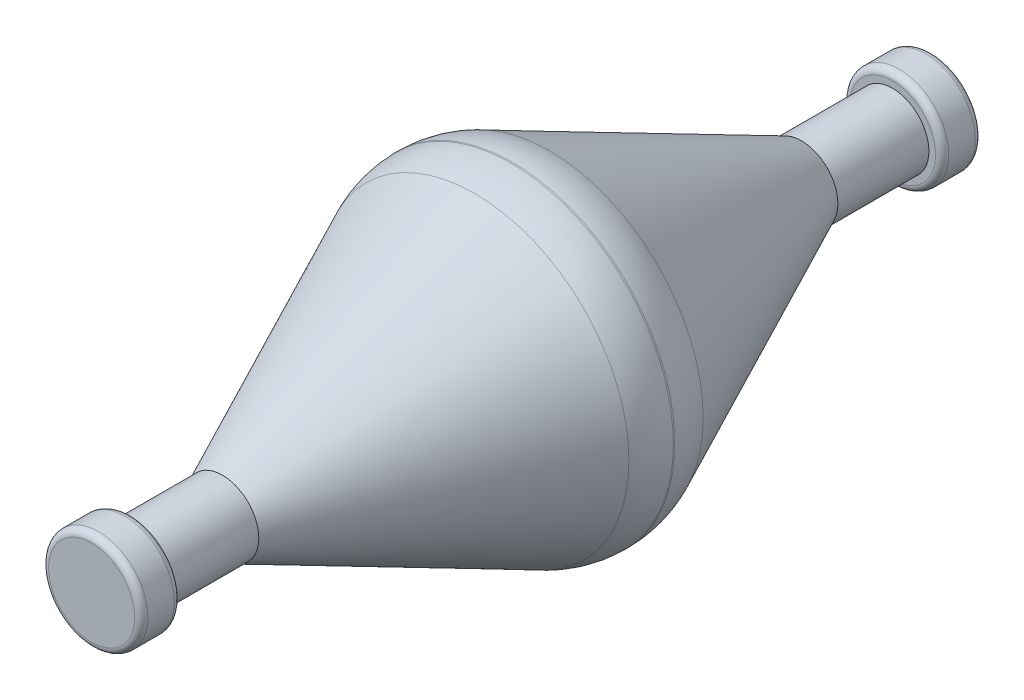
ISO-10303-21;
HEADER;
FILE_DESCRIPTION(('STEP AP214'),'2;1');
FILE_NAME('part.step','',(''),(''),'','','');
FILE_SCHEMA(('AUTOMOTIVE_DESIGN { 1 0 10303 214 1 1 1 1 }'));
ENDSEC;
DATA;
#1=APPLICATION_CONTEXT('core data for automotive mechanical design processes');
#2=APPLICATION_PROTOCOL_DEFINITION('international standard','automotive_design',2000,#1);
#3=PRODUCT_CONTEXT('',#1,'mechanical');
#4=PRODUCT('Part','Part','',(#3));
#5=PRODUCT_RELATED_PRODUCT_CATEGORY('part','',(#4));
#6=PRODUCT_DEFINITION_FORMATION('','',#4);
#7=PRODUCT_DEFINITION_CONTEXT('part definition',#1,'design');
#8=PRODUCT_DEFINITION('design','',#6,#7);
#9=PRODUCT_DEFINITION_SHAPE('','',#8);
#10=(LENGTH_UNIT() NAMED_UNIT(*) SI_UNIT(.MILLI.,.METRE.));
#11=(NAMED_UNIT(*) PLANE_ANGLE_UNIT() SI_UNIT($,.RADIAN.));
#12=(NAMED_UNIT(*) SI_UNIT($,.STERADIAN.) SOLID_ANGLE_UNIT());
#13=UNCERTAINTY_MEASURE_WITH_UNIT(LENGTH_MEASURE(1.E-05),#10,'distance_accuracy_value','');
#14=(GEOMETRIC_REPRESENTATION_CONTEXT(3) GLOBAL_UNCERTAINTY_ASSIGNED_CONTEXT((#13)) GLOBAL_UNIT_ASSIGNED_CONTEXT((#10,
#11,#12)) REPRESENTATION_CONTEXT('',''));
#15=CARTESIAN_POINT('',(0.,0.,0.));
#16=DIRECTION('',(0.,0.,1.));
#17=DIRECTION('',(1.,0.,0.));
#18=AXIS2_PLACEMENT_3D('',#15,#16,#17);
#19=CARTESIAN_POINT('',(0.,0.,-4.875));
#20=DIRECTION('',(0.,0.,1.));
#21=DIRECTION('',(1.,0.,0.));
#22=AXIS2_PLACEMENT_3D('',#19,#20,#21);
#23=CYLINDRICAL_SURFACE('',#22,1.375);
#24=CARTESIAN_POINT('',(0.,0.,21.9364078724202));
#25=DIRECTION('',(0.,0.,-1.));
#26=DIRECTION('',(-1.,0.,0.));
#27=AXIS2_PLACEMENT_3D('',#24,#25,#26);
#28=CIRCLE('',#27,1.375);
#29=CARTESIAN_POINT('',(-1.375,0.,21.9364078724202));
#30=VERTEX_POINT('',#29);
#31=EDGE_CURVE('E80',#30,#30,#28,.F.);
#32=ORIENTED_EDGE('',*,*,#31,.T.);
#33=EDGE_LOOP('',(#32));
#34=FACE_BOUND('',#33,.T.);
#35=CARTESIAN_POINT('',(0.,0.,25.375));
#36=DIRECTION('',(0.,0.,1.));
#37=DIRECTION('',(1.,0.,0.));
#38=AXIS2_PLACEMENT_3D('',#35,#36,#37);
#39=CIRCLE('',#38,1.375);
#40=CARTESIAN_POINT('',(1.375,0.,25.375));
#41=VERTEX_POINT('',#40);
#42=EDGE_CURVE('E87',#41,#41,#39,.F.);
#43=ORIENTED_EDGE('',*,*,#42,.T.);
#44=EDGE_LOOP('',(#43));
#45=FACE_BOUND('',#44,.T.);
#46=ADVANCED_FACE('F36',(#34,#45),#23,.T.);
#47=CARTESIAN_POINT('',(0.,0.,0.0635921275798177));
#48=DIRECTION('',(0.,0.,1.));
#49=DIRECTION('',(1.,0.,0.));
#50=AXIS2_PLACEMENT_3D('',#47,#48,#49);
#51=CIRCLE('',#50,1.375);
#52=CARTESIAN_POINT('',(1.375,0.,0.0635921275798177));
#53=VERTEX_POINT('',#52);
#54=EDGE_CURVE('E83',#53,#53,#51,.F.);
#55=ORIENTED_EDGE('',*,*,#54,.T.);
#56=EDGE_LOOP('',(#55));
#57=FACE_BOUND('',#56,.T.);
#58=CARTESIAN_POINT('',(0.,0.,-3.375));
#59=DIRECTION('',(0.,0.,-1.));
#60=DIRECTION('',(-1.,0.,0.));
#61=AXIS2_PLACEMENT_3D('',#58,#59,#60);
#62=CIRCLE('',#61,1.375);
#63=CARTESIAN_POINT('',(-1.375,0.,-3.375));
#64=VERTEX_POINT('',#63);
#65=EDGE_CURVE('E86',#64,#64,#62,.F.);
#66=ORIENTED_EDGE('',*,*,#65,.T.);
#67=EDGE_LOOP('',(#66));
#68=FACE_BOUND('',#67,.T.);
#69=ADVANCED_FACE('F93',(#57,#68),#23,.T.);
#70=CARTESIAN_POINT('',(0.,0.,22.));
#71=DIRECTION('',(0.,0.,-1.));
#72=DIRECTION('',(-1.,0.,0.));
#73=AXIS2_PLACEMENT_3D('',#70,#71,#72);
#74=CYLINDRICAL_SURFACE('',#73,6.125);
#75=CARTESIAN_POINT('',(0.,0.,11.0294923464104));
#76=DIRECTION('',(0.,0.,1.));
#77=DIRECTION('',(1.,0.,0.));
#78=AXIS2_PLACEMENT_3D('',#75,#76,#77);
#79=CIRCLE('',#78,6.125);
#80=CARTESIAN_POINT('',(6.125,0.,11.0294923464104));
#81=VERTEX_POINT('',#80);
#82=EDGE_CURVE('E74',#81,#81,#79,.F.);
#83=ORIENTED_EDGE('',*,*,#82,.T.);
#84=EDGE_LOOP('',(#83));
#85=FACE_BOUND('',#84,.T.);
#86=CARTESIAN_POINT('',(0.,0.,10.9705076535896));
#87=DIRECTION('',(0.,0.,-1.));
#88=DIRECTION('',(-1.,0.,0.));
#89=AXIS2_PLACEMENT_3D('',#86,#87,#88);
#90=CIRCLE('',#89,6.125);
#91=CARTESIAN_POINT('',(-6.125,0.,10.9705076535896));
#92=VERTEX_POINT('',#91);
#93=EDGE_CURVE('E77',#92,#92,#90,.F.);
#94=ORIENTED_EDGE('',*,*,#93,.T.);
#95=EDGE_LOOP('',(#94));
#96=FACE_BOUND('',#95,.T.);
#97=ADVANCED_FACE('F108',(#85,#96),#74,.T.);
#98=CARTESIAN_POINT('',(0.,0.,-3.375));
#99=DIRECTION('',(0.,0.,-1.));
#100=DIRECTION('',(-1.,0.,0.));
#101=AXIS2_PLACEMENT_3D('',#98,#99,#100);
#102=CYLINDRICAL_SURFACE('',#101,1.875);
#103=CARTESIAN_POINT('',(0.,0.,-3.625));
#104=DIRECTION('',(0.,0.,-1.));
#105=DIRECTION('',(-1.,0.,0.));
#106=AXIS2_PLACEMENT_3D('',#103,#104,#105);
#107=CIRCLE('',#106,1.875);
#108=CARTESIAN_POINT('',(-1.875,0.,-3.625));
#109=VERTEX_POINT('',#108);
#110=EDGE_CURVE('E62',#109,#109,#107,.T.);
#111=ORIENTED_EDGE('',*,*,#110,.T.);
#112=EDGE_LOOP('',(#111));
#113=FACE_BOUND('',#112,.T.);
#114=CARTESIAN_POINT('',(0.,0.,-4.625));
#115=DIRECTION('',(0.,0.,1.));
#116=DIRECTION('',(1.,0.,0.));
#117=AXIS2_PLACEMENT_3D('',#114,#115,#116);
#118=CIRCLE('',#117,1.875);
#119=CARTESIAN_POINT('',(1.875,0.,-4.625));
#120=VERTEX_POINT('',#119);
#121=EDGE_CURVE('E65',#120,#120,#118,.T.);
#122=ORIENTED_EDGE('',*,*,#121,.T.);
#123=EDGE_LOOP('',(#122));
#124=FACE_BOUND('',#123,.T.);
#125=ADVANCED_FACE('F98',(#113,#124),#102,.T.);
#126=CARTESIAN_POINT('',(0.,0.,-3.375));
#127=DIRECTION('',(0.,0.,-1.));
#128=DIRECTION('',(-1.,0.,0.));
#129=AXIS2_PLACEMENT_3D('',#126,#127,#128);
#130=PLANE('',#129);
#131=CARTESIAN_POINT('',(0.,0.,-3.375));
#132=DIRECTION('',(0.,0.,-1.));
#133=DIRECTION('',(-1.,0.,0.));
#134=AXIS2_PLACEMENT_3D('',#131,#132,#133);
#135=CIRCLE('',#134,1.625);
#136=CARTESIAN_POINT('',(-1.625,0.,-3.375));
#137=VERTEX_POINT('',#136);
#138=EDGE_CURVE('E59',#137,#137,#135,.F.);
#139=ORIENTED_EDGE('',*,*,#138,.T.);
#140=EDGE_LOOP('',(#139));
#141=FACE_BOUND('',#140,.T.);
#142=ORIENTED_EDGE('',*,*,#65,.F.);
#143=EDGE_LOOP('',(#142));
#144=FACE_BOUND('',#143,.T.);
#145=ADVANCED_FACE('F95',(#141,#144),#130,.F.);
#146=CARTESIAN_POINT('',(0.,0.,-4.875));
#147=DIRECTION('',(0.,0.,1.));
#148=DIRECTION('',(1.,0.,0.));
#149=AXIS2_PLACEMENT_3D('',#146,#147,#148);
#150=PLANE('',#149);
#151=CARTESIAN_POINT('',(0.,0.,-4.875));
#152=DIRECTION('',(0.,0.,1.));
#153=DIRECTION('',(1.,0.,0.));
#154=AXIS2_PLACEMENT_3D('',#151,#152,#153);
#155=CIRCLE('',#154,1.625);
#156=CARTESIAN_POINT('',(1.625,0.,-4.875));
#157=VERTEX_POINT('',#156);
#158=EDGE_CURVE('E56',#157,#157,#155,.F.);
#159=ORIENTED_EDGE('',*,*,#158,.T.);
#160=EDGE_LOOP('',(#159));
#161=FACE_BOUND('',#160,.T.);
#162=ADVANCED_FACE('F97',(#161),#150,.F.);
#163=CARTESIAN_POINT('',(0.,0.,25.375));
#164=DIRECTION('',(0.,0.,1.));
#165=DIRECTION('',(1.,0.,0.));
#166=AXIS2_PLACEMENT_3D('',#163,#164,#165);
#167=CYLINDRICAL_SURFACE('',#166,1.875);
#168=CARTESIAN_POINT('',(0.,0.,25.625));
#169=DIRECTION('',(0.,0.,1.));
#170=DIRECTION('',(1.,0.,0.));
#171=AXIS2_PLACEMENT_3D('',#168,#169,#170);
#172=CIRCLE('',#171,1.875);
#173=CARTESIAN_POINT('',(1.875,0.,25.625));
#174=VERTEX_POINT('',#173);
#175=EDGE_CURVE('E47',#174,#174,#172,.T.);
#176=ORIENTED_EDGE('',*,*,#175,.T.);
#177=EDGE_LOOP('',(#176));
#178=FACE_BOUND('',#177,.T.);
#179=CARTESIAN_POINT('',(0.,0.,26.625));
#180=DIRECTION('',(0.,0.,1.));
#181=DIRECTION('',(1.,0.,0.));
#182=AXIS2_PLACEMENT_3D('',#179,#180,#181);
#183=CIRCLE('',#182,1.875);
#184=CARTESIAN_POINT('',(1.875,0.,26.625));
#185=VERTEX_POINT('',#184);
#186=EDGE_CURVE('E51',#185,#185,#183,.F.);
#187=ORIENTED_EDGE('',*,*,#186,.T.);
#188=EDGE_LOOP('',(#187));
#189=FACE_BOUND('',#188,.T.);
#190=ADVANCED_FACE('F105',(#178,#189),#167,.T.);
#191=CARTESIAN_POINT('',(0.,0.,25.375));
#192=DIRECTION('',(0.,0.,1.));
#193=DIRECTION('',(1.,0.,0.));
#194=AXIS2_PLACEMENT_3D('',#191,#192,#193);
#195=PLANE('',#194);
#196=CARTESIAN_POINT('',(0.,0.,25.375));
#197=DIRECTION('',(0.,0.,1.));
#198=DIRECTION('',(1.,0.,0.));
#199=AXIS2_PLACEMENT_3D('',#196,#197,#198);
#200=CIRCLE('',#199,1.625);
#201=CARTESIAN_POINT('',(1.625,0.,25.375));
#202=VERTEX_POINT('',#201);
#203=EDGE_CURVE('E43',#202,#202,#200,.F.);
#204=ORIENTED_EDGE('',*,*,#203,.T.);
#205=EDGE_LOOP('',(#204));
#206=FACE_BOUND('',#205,.T.);
#207=ORIENTED_EDGE('',*,*,#42,.F.);
#208=EDGE_LOOP('',(#207));
#209=FACE_BOUND('',#208,.T.);
#210=ADVANCED_FACE('F167',(#206,#209),#195,.F.);
#211=CARTESIAN_POINT('',(0.,0.,26.875));
#212=DIRECTION('',(0.,0.,1.));
#213=DIRECTION('',(1.,0.,0.));
#214=AXIS2_PLACEMENT_3D('',#211,#212,#213);
#215=PLANE('',#214);
#216=CARTESIAN_POINT('',(0.,0.,26.875));
#217=DIRECTION('',(0.,0.,1.));
#218=DIRECTION('',(1.,0.,0.));
#219=AXIS2_PLACEMENT_3D('',#216,#217,#218);
#220=CIRCLE('',#219,1.625);
#221=CARTESIAN_POINT('',(1.625,0.,26.875));
#222=VERTEX_POINT('',#221);
#223=EDGE_CURVE('E10',#222,#222,#220,.T.);
#224=ORIENTED_EDGE('',*,*,#223,.T.);
#225=EDGE_LOOP('',(#224));
#226=FACE_BOUND('',#225,.T.);
#227=ADVANCED_FACE('F133',(#226),#215,.T.);
#228=CARTESIAN_POINT('',(0.,0.,10.25));
#229=DIRECTION('',(0.,0.,1.));
#230=DIRECTION('',(1.,0.,0.));
#231=AXIS2_PLACEMENT_3D('',#228,#229,#230);
#232=CONICAL_SURFACE('',#231,6.125,0.436332312998589);
#233=CARTESIAN_POINT('',(0.,0.,9.59699830293231));
#234=DIRECTION('',(0.,0.,1.));
#235=DIRECTION('',(1.,0.,0.));
#236=AXIS2_PLACEMENT_3D('',#233,#234,#235);
#237=CIRCLE('',#236,5.8205003078691);
#238=CARTESIAN_POINT('',(5.8205003078691,0.,9.59699830293231));
#239=VERTEX_POINT('',#238);
#240=EDGE_CURVE('E68',#239,#239,#237,.F.);
#241=CARTESIAN_POINT('',(5.8205003078691,0.,9.59699830293231));
#242=CARTESIAN_POINT('',(5.77419301299547,0.,9.49769198860572));
#243=CARTESIAN_POINT('',(5.72788571812183,0.,9.39838567427913));
#244=CARTESIAN_POINT('',(5.63527112837456,0.,9.19977304562595));
#245=CARTESIAN_POINT('',(5.58896383350092,0.,9.10046673129937));
#246=CARTESIAN_POINT('',(5.49634924375365,0.,8.90185410264619));
#247=CARTESIAN_POINT('',(5.45004194888001,0.,8.8025477883196));
#248=CARTESIAN_POINT('',(5.35742735913274,0.,8.60393515966642));
#249=CARTESIAN_POINT('',(5.3111200642591,0.,8.50462884533984));
#250=CARTESIAN_POINT('',(5.21850547451183,0.,8.30601621668666));
#251=CARTESIAN_POINT('',(5.17219817963819,0.,8.20670990236007));
#252=CARTESIAN_POINT('',(5.07958358989092,0.,8.00809727370689));
#253=CARTESIAN_POINT('',(5.03327629501728,0.,7.9087909593803));
#254=CARTESIAN_POINT('',(4.94066170527001,0.,7.71017833072713));
#255=CARTESIAN_POINT('',(4.89435441039637,0.,7.61087201640054));
#256=CARTESIAN_POINT('',(4.8017398206491,0.,7.41225938774736));
#257=CARTESIAN_POINT('',(4.75543252577546,0.,7.31295307342078));
#258=CARTESIAN_POINT('',(4.66281793602819,0.,7.1143404447676));
#259=CARTESIAN_POINT('',(4.61651064115456,0.,7.01503413044101));
#260=CARTESIAN_POINT('',(4.52389605140728,0.,6.81642150178783));
#261=CARTESIAN_POINT('',(4.47758875653365,0.,6.71711518746124));
#262=CARTESIAN_POINT('',(4.38497416678637,0.,6.51850255880807));
#263=CARTESIAN_POINT('',(4.33866687191274,0.,6.41919624448148));
#264=CARTESIAN_POINT('',(4.24605228216546,0.,6.2205836158283));
#265=CARTESIAN_POINT('',(4.19974498729183,0.,6.12127730150171));
#266=CARTESIAN_POINT('',(4.10713039754455,0.,5.92266467284854));
#267=CARTESIAN_POINT('',(4.06082310267092,0.,5.82335835852195));
#268=CARTESIAN_POINT('',(3.96820851292364,0.,5.62474572986877));
#269=CARTESIAN_POINT('',(3.92190121805001,0.,5.52543941554218));
#270=CARTESIAN_POINT('',(3.82928662830273,0.,5.32682678688901));
#271=CARTESIAN_POINT('',(3.7829793334291,0.,5.22752047256242));
#272=CARTESIAN_POINT('',(3.69036474368182,0.,5.02890784390924));
#273=CARTESIAN_POINT('',(3.64405744880819,0.,4.92960152958265));
#274=CARTESIAN_POINT('',(3.55144285906092,0.,4.73098890092947));
#275=CARTESIAN_POINT('',(3.50513556418728,0.,4.63168258660289));
#276=CARTESIAN_POINT('',(3.41252097444001,0.,4.43306995794971));
#277=CARTESIAN_POINT('',(3.36621367956637,0.,4.33376364362312));
#278=CARTESIAN_POINT('',(3.2735990898191,0.,4.13515101496994));
#279=CARTESIAN_POINT('',(3.22729179494546,0.,4.03584470064336));
#280=CARTESIAN_POINT('',(3.13467720519819,0.,3.83723207199018));
#281=CARTESIAN_POINT('',(3.08836991032455,0.,3.73792575766359));
#282=CARTESIAN_POINT('',(2.99575532057728,0.,3.53931312901041));
#283=CARTESIAN_POINT('',(2.94944802570364,0.,3.44000681468383));
#284=CARTESIAN_POINT('',(2.85683343595637,0.,3.24139418603065));
#285=CARTESIAN_POINT('',(2.81052614108273,0.,3.14208787170406));
#286=CARTESIAN_POINT('',(2.71791155133546,0.,2.94347524305088));
#287=CARTESIAN_POINT('',(2.67160425646182,0.,2.84416892872429));
#288=CARTESIAN_POINT('',(2.57898966671455,0.,2.64555630007112));
#289=CARTESIAN_POINT('',(2.53268237184091,0.,2.54624998574453));
#290=CARTESIAN_POINT('',(2.44006778209364,0.,2.34763735709135));
#291=CARTESIAN_POINT('',(2.39376048722,0.,2.24833104276476));
#292=CARTESIAN_POINT('',(2.30114589747273,0.,2.04971841411159));
#293=CARTESIAN_POINT('',(2.25483860259909,0.,1.950412099785));
#294=CARTESIAN_POINT('',(2.16222401285182,0.,1.75179947113182));
#295=CARTESIAN_POINT('',(2.11591671797818,0.,1.65249315680523));
#296=CARTESIAN_POINT('',(2.02330212823091,0.,1.45388052815206));
#297=CARTESIAN_POINT('',(1.97699483335727,0.,1.35457421382547));
#298=CARTESIAN_POINT('',(1.88438024361,0.,1.15596158517229));
#299=CARTESIAN_POINT('',(1.83807294873637,0.,1.0566552708457));
#300=CARTESIAN_POINT('',(1.74545835898909,0.,0.858042642192526));
#301=CARTESIAN_POINT('',(1.69915106411546,0.,0.758736327865937));
#302=CARTESIAN_POINT('',(1.60653647436818,0.,0.560123699212759));
#303=CARTESIAN_POINT('',(1.56022917949454,0.,0.460817384886171));
#304=CARTESIAN_POINT('',(1.46761458974727,0.,0.262204756232994));
#305=CARTESIAN_POINT('',(1.42130729487364,0.,0.162898441906406));
#306=CARTESIAN_POINT('',(1.375,0.,0.0635921275798177));
#307=B_SPLINE_CURVE_WITH_KNOTS('',3,(#241,#242,#243,#244,#245,#246,#247,#248,#249,#250,#251,
#252,#253,#254,#255,#256,#257,#258,#259,#260,#261,#262,#263,#264,#265,#266,#267,#268,#269,#270,
#271,#272,#273,#274,#275,#276,#277,#278,#279,#280,#281,#282,#283,#284,#285,#286,#287,#288,#289,
#290,#291,#292,#293,#294,#295,#296,#297,#298,#299,#300,#301,#302,#303,#304,#305,#306),
.UNSPECIFIED.,.F.,.F.,(4,2,2,2,2,2,2,2,2,2,2,2,2,2,2,2,2,2,2,2,2,2,2,2,2,2,2,2,2,2,2,2,4),(0.,
0.328717183324521,0.657434366649041,0.98615154997356,1.31486873329808,1.6435859166226,
1.97230309994712,2.30102028327164,2.62973746659616,2.95845464992068,3.2871718332452,
3.61588901656972,3.94460619989424,4.27332338321876,4.60204056654328,4.9307577498678,
5.25947493319232,5.58819211651684,5.91690929984136,6.24562648316588,6.5743436664904,
6.90306084981492,7.23177803313944,7.56049521646396,7.88921239978848,8.217929583113,
8.54664676643752,8.87536394976204,9.20408113308656,9.53279831641108,9.8615154997356,
10.1902326830601,10.5189498663846),.UNSPECIFIED.);
#308=EDGE_CURVE('BSEAM126',#239,#53,#307,.T.);
#309=ORIENTED_EDGE('',*,*,#240,.T.);
#310=ORIENTED_EDGE('',*,*,#54,.F.);
#311=ORIENTED_EDGE('',*,*,#308,.T.);
#312=ORIENTED_EDGE('',*,*,#308,.F.);
#313=EDGE_LOOP('',(#309,#311,#310,#312));
#314=FACE_BOUND('',#313,.T.);
#315=ADVANCED_FACE('F126',(#314),#232,.T.);
#316=CARTESIAN_POINT('',(0.,0.,22.));
#317=DIRECTION('',(0.,0.,-1.));
#318=DIRECTION('',(-1.,0.,0.));
#319=AXIS2_PLACEMENT_3D('',#316,#317,#318);
#320=CONICAL_SURFACE('',#319,1.34534650391116,0.436332312998589);
#321=CARTESIAN_POINT('',(0.,0.,12.4030016970677));
#322=DIRECTION('',(0.,0.,-1.));
#323=DIRECTION('',(-1.,0.,0.));
#324=AXIS2_PLACEMENT_3D('',#321,#322,#323);
#325=CIRCLE('',#324,5.8205003078691);
#326=CARTESIAN_POINT('',(-5.8205003078691,0.,12.4030016970677));
#327=VERTEX_POINT('',#326);
#328=EDGE_CURVE('E71',#327,#327,#325,.F.);
#329=CARTESIAN_POINT('',(-5.8205003078691,0.,12.4030016970677));
#330=CARTESIAN_POINT('',(-5.77419301299547,0.,12.5023080113943));
#331=CARTESIAN_POINT('',(-5.72788571812183,0.,12.6016143257209));
#332=CARTESIAN_POINT('',(-5.63527112837456,0.,12.800226954374));
#333=CARTESIAN_POINT('',(-5.58896383350092,0.,12.8995332687006));
#334=CARTESIAN_POINT('',(-5.49634924375365,0.,13.0981458973538));
#335=CARTESIAN_POINT('',(-5.45004194888001,0.,13.1974522116804));
#336=CARTESIAN_POINT('',(-5.35742735913274,0.,13.3960648403336));
#337=CARTESIAN_POINT('',(-5.3111200642591,0.,13.4953711546602));
#338=CARTESIAN_POINT('',(-5.21850547451183,0.,13.6939837833133));
#339=CARTESIAN_POINT('',(-5.17219817963819,0.,13.7932900976399));
#340=CARTESIAN_POINT('',(-5.07958358989092,0.,13.9919027262931));
#341=CARTESIAN_POINT('',(-5.03327629501728,0.,14.0912090406197));
#342=CARTESIAN_POINT('',(-4.94066170527001,0.,14.2898216692729));
#343=CARTESIAN_POINT('',(-4.89435441039637,0.,14.3891279835995));
#344=CARTESIAN_POINT('',(-4.8017398206491,0.,14.5877406122526));
#345=CARTESIAN_POINT('',(-4.75543252577546,0.,14.6870469265792));
#346=CARTESIAN_POINT('',(-4.66281793602819,0.,14.8856595552324));
#347=CARTESIAN_POINT('',(-4.61651064115455,0.,14.984965869559));
#348=CARTESIAN_POINT('',(-4.52389605140728,0.,15.1835784982122));
#349=CARTESIAN_POINT('',(-4.47758875653364,0.,15.2828848125388));
#350=CARTESIAN_POINT('',(-4.38497416678637,0.,15.4814974411919));
#351=CARTESIAN_POINT('',(-4.33866687191273,0.,15.5808037555185));
#352=CARTESIAN_POINT('',(-4.24605228216546,0.,15.7794163841717));
#353=CARTESIAN_POINT('',(-4.19974498729183,0.,15.8787226984983));
#354=CARTESIAN_POINT('',(-4.10713039754455,0.,16.0773353271515));
#355=CARTESIAN_POINT('',(-4.06082310267092,0.,16.1766416414781));
#356=CARTESIAN_POINT('',(-3.96820851292364,0.,16.3752542701312));
#357=CARTESIAN_POINT('',(-3.92190121805001,0.,16.4745605844578));
#358=CARTESIAN_POINT('',(-3.82928662830273,0.,16.673173213111));
#359=CARTESIAN_POINT('',(-3.7829793334291,0.,16.7724795274376));
#360=CARTESIAN_POINT('',(-3.69036474368182,0.,16.9710921560908));
#361=CARTESIAN_POINT('',(-3.64405744880819,0.,17.0703984704173));
#362=CARTESIAN_POINT('',(-3.55144285906091,0.,17.2690110990705));
#363=CARTESIAN_POINT('',(-3.50513556418728,0.,17.3683174133971));
#364=CARTESIAN_POINT('',(-3.41252097444,0.,17.5669300420503));
#365=CARTESIAN_POINT('',(-3.36621367956637,0.,17.6662363563769));
#366=CARTESIAN_POINT('',(-3.2735990898191,0.,17.8648489850301));
#367=CARTESIAN_POINT('',(-3.22729179494546,0.,17.9641552993566));
#368=CARTESIAN_POINT('',(-3.13467720519819,0.,18.1627679280098));
#369=CARTESIAN_POINT('',(-3.08836991032455,0.,18.2620742423364));
#370=CARTESIAN_POINT('',(-2.99575532057728,0.,18.4606868709896));
#371=CARTESIAN_POINT('',(-2.94944802570364,0.,18.5599931853162));
#372=CARTESIAN_POINT('',(-2.85683343595637,0.,18.7586058139693));
#373=CARTESIAN_POINT('',(-2.81052614108273,0.,18.8579121282959));
#374=CARTESIAN_POINT('',(-2.71791155133546,0.,19.0565247569491));
#375=CARTESIAN_POINT('',(-2.67160425646182,0.,19.1558310712757));
#376=CARTESIAN_POINT('',(-2.57898966671455,0.,19.3544436999289));
#377=CARTESIAN_POINT('',(-2.53268237184091,0.,19.4537500142555));
#378=CARTESIAN_POINT('',(-2.44006778209364,0.,19.6523626429086));
#379=CARTESIAN_POINT('',(-2.39376048722,0.,19.7516689572352));
#380=CARTESIAN_POINT('',(-2.30114589747273,0.,19.9502815858884));
#381=CARTESIAN_POINT('',(-2.25483860259909,0.,20.049587900215));
#382=CARTESIAN_POINT('',(-2.16222401285182,0.,20.2482005288682));
#383=CARTESIAN_POINT('',(-2.11591671797818,0.,20.3475068431948));
#384=CARTESIAN_POINT('',(-2.02330212823091,0.,20.5461194718479));
#385=CARTESIAN_POINT('',(-1.97699483335727,0.,20.6454257861745));
#386=CARTESIAN_POINT('',(-1.88438024361,0.,20.8440384148277));
#387=CARTESIAN_POINT('',(-1.83807294873636,0.,20.9433447291543));
#388=CARTESIAN_POINT('',(-1.74545835898909,0.,21.1419573578075));
#389=CARTESIAN_POINT('',(-1.69915106411545,0.,21.2412636721341));
#390=CARTESIAN_POINT('',(-1.60653647436818,0.,21.4398763007872));
#391=CARTESIAN_POINT('',(-1.56022917949455,0.,21.5391826151138));
#392=CARTESIAN_POINT('',(-1.46761458974727,0.,21.737795243767));
#393=CARTESIAN_POINT('',(-1.42130729487364,0.,21.8371015580936));
#394=CARTESIAN_POINT('',(-1.375,0.,21.9364078724202));
#395=B_SPLINE_CURVE_WITH_KNOTS('',3,(#329,#330,#331,#332,#333,#334,#335,#336,#337,#338,#339,
#340,#341,#342,#343,#344,#345,#346,#347,#348,#349,#350,#351,#352,#353,#354,#355,#356,#357,#358,
#359,#360,#361,#362,#363,#364,#365,#366,#367,#368,#369,#370,#371,#372,#373,#374,#375,#376,#377,
#378,#379,#380,#381,#382,#383,#384,#385,#386,#387,#388,#389,#390,#391,#392,#393,#394),
.UNSPECIFIED.,.F.,.F.,(4,2,2,2,2,2,2,2,2,2,2,2,2,2,2,2,2,2,2,2,2,2,2,2,2,2,2,2,2,2,2,2,4),(0.,
0.328717183324519,0.657434366649039,0.98615154997356,1.31486873329808,1.6435859166226,
1.97230309994712,2.30102028327164,2.62973746659616,2.95845464992068,3.2871718332452,
3.61588901656972,3.94460619989424,4.27332338321876,4.60204056654328,4.9307577498678,
5.25947493319232,5.58819211651684,5.91690929984136,6.24562648316588,6.5743436664904,
6.90306084981492,7.23177803313944,7.56049521646396,7.88921239978847,8.217929583113,
8.54664676643752,8.87536394976204,9.20408113308656,9.53279831641108,9.8615154997356,
10.1902326830601,10.5189498663846),.UNSPECIFIED.);
#396=EDGE_CURVE('BSEAM132',#327,#30,#395,.T.);
#397=ORIENTED_EDGE('',*,*,#328,.T.);
#398=ORIENTED_EDGE('',*,*,#31,.F.);
#399=ORIENTED_EDGE('',*,*,#396,.T.);
#400=ORIENTED_EDGE('',*,*,#396,.F.);
#401=EDGE_LOOP('',(#397,#399,#398,#400));
#402=FACE_BOUND('',#401,.T.);
#403=ADVANCED_FACE('F132',(#402),#320,.T.);
#404=CARTESIAN_POINT('',(0.,0.,11.0294923464104));
#405=DIRECTION('',(0.,0.,1.));
#406=DIRECTION('',(1.,0.,0.));
#407=AXIS2_PLACEMENT_3D('',#404,#405,#406);
#408=DEGENERATE_TOROIDAL_SURFACE('',#407,2.875,3.25,.T.);
#409=ORIENTED_EDGE('',*,*,#328,.F.);
#410=EDGE_LOOP('',(#409));
#411=FACE_BOUND('',#410,.T.);
#412=ORIENTED_EDGE('',*,*,#82,.F.);
#413=EDGE_LOOP('',(#412));
#414=FACE_BOUND('',#413,.T.);
#415=ADVANCED_FACE('F139',(#411,#414),#408,.T.);
#416=CARTESIAN_POINT('',(0.,0.,10.9705076535896));
#417=DIRECTION('',(0.,0.,-1.));
#418=DIRECTION('',(-1.,0.,0.));
#419=AXIS2_PLACEMENT_3D('',#416,#417,#418);
#420=DEGENERATE_TOROIDAL_SURFACE('',#419,2.875,3.25,.T.);
#421=ORIENTED_EDGE('',*,*,#240,.F.);
#422=EDGE_LOOP('',(#421));
#423=FACE_BOUND('',#422,.T.);
#424=ORIENTED_EDGE('',*,*,#93,.F.);
#425=EDGE_LOOP('',(#424));
#426=FACE_BOUND('',#425,.T.);
#427=ADVANCED_FACE('F143',(#423,#426),#420,.T.);
#428=CARTESIAN_POINT('',(0.,0.,-3.625));
#429=DIRECTION('',(0.,0.,-1.));
#430=DIRECTION('',(-1.,0.,0.));
#431=AXIS2_PLACEMENT_3D('',#428,#429,#430);
#432=TOROIDAL_SURFACE('',#431,1.625,0.25);
#433=ORIENTED_EDGE('',*,*,#138,.F.);
#434=EDGE_LOOP('',(#433));
#435=FACE_BOUND('',#434,.T.);
#436=ORIENTED_EDGE('',*,*,#110,.F.);
#437=EDGE_LOOP('',(#436));
#438=FACE_BOUND('',#437,.T.);
#439=ADVANCED_FACE('F147',(#435,#438),#432,.T.);
#440=CARTESIAN_POINT('',(0.,0.,-4.625));
#441=DIRECTION('',(0.,0.,1.));
#442=DIRECTION('',(1.,0.,0.));
#443=AXIS2_PLACEMENT_3D('',#440,#441,#442);
#444=TOROIDAL_SURFACE('',#443,1.625,0.25);
#445=ORIENTED_EDGE('',*,*,#121,.F.);
#446=EDGE_LOOP('',(#445));
#447=FACE_BOUND('',#446,.T.);
#448=ORIENTED_EDGE('',*,*,#158,.F.);
#449=EDGE_LOOP('',(#448));
#450=FACE_BOUND('',#449,.T.);
#451=ADVANCED_FACE('F151',(#447,#450),#444,.T.);
#452=CARTESIAN_POINT('',(0.,0.,25.625));
#453=DIRECTION('',(0.,0.,1.));
#454=DIRECTION('',(1.,0.,0.));
#455=AXIS2_PLACEMENT_3D('',#452,#453,#454);
#456=TOROIDAL_SURFACE('',#455,1.625,0.25);
#457=ORIENTED_EDGE('',*,*,#203,.F.);
#458=EDGE_LOOP('',(#457));
#459=FACE_BOUND('',#458,.T.);
#460=ORIENTED_EDGE('',*,*,#175,.F.);
#461=EDGE_LOOP('',(#460));
#462=FACE_BOUND('',#461,.T.);
#463=ADVANCED_FACE('F154',(#459,#462),#456,.T.);
#464=CARTESIAN_POINT('',(0.,0.,26.625));
#465=DIRECTION('',(0.,0.,1.));
#466=DIRECTION('',(1.,0.,0.));
#467=AXIS2_PLACEMENT_3D('',#464,#465,#466);
#468=TOROIDAL_SURFACE('',#467,1.625,0.25);
#469=ORIENTED_EDGE('',*,*,#186,.F.);
#470=EDGE_LOOP('',(#469));
#471=FACE_BOUND('',#470,.T.);
#472=ORIENTED_EDGE('',*,*,#223,.F.);
#473=EDGE_LOOP('',(#472));
#474=FACE_BOUND('',#473,.T.);
#475=ADVANCED_FACE('F38',(#471,#474),#468,.T.);
#476=CLOSED_SHELL('',(#46,#69,#97,#125,#145,#162,#190,#210,#227,#315,#403,#415,#427,#439,#451,
#463,#475));
#477=MANIFOLD_SOLID_BREP('B2',#476);
#478=ADVANCED_BREP_SHAPE_REPRESENTATION('',(#18,#477),#14);
#479=SHAPE_DEFINITION_REPRESENTATION(#9,#478);
ENDSEC;
END-ISO-10303-21;
